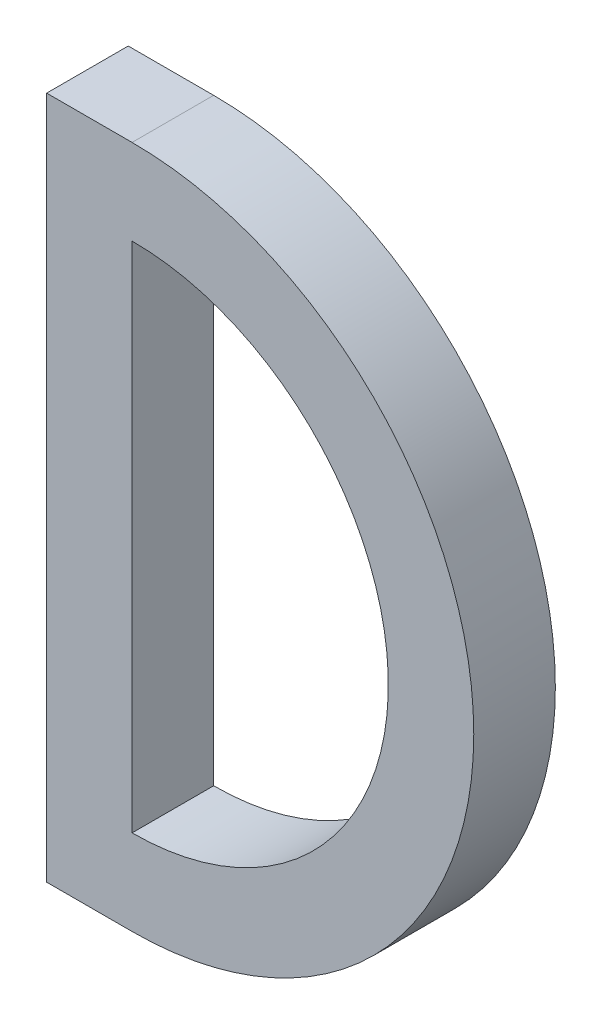
ISO-10303-21;
HEADER;
FILE_DESCRIPTION(('STEP AP214'),'2;1');
FILE_NAME('part.step','',(''),(''),'','','');
FILE_SCHEMA(('AUTOMOTIVE_DESIGN { 1 0 10303 214 1 1 1 1 }'));
ENDSEC;
DATA;
#1=APPLICATION_CONTEXT('core data for automotive mechanical design processes');
#2=APPLICATION_PROTOCOL_DEFINITION('international standard','automotive_design',2000,#1);
#3=PRODUCT_CONTEXT('',#1,'mechanical');
#4=PRODUCT('Part','Part','',(#3));
#5=PRODUCT_RELATED_PRODUCT_CATEGORY('part','',(#4));
#6=PRODUCT_DEFINITION_FORMATION('','',#4);
#7=PRODUCT_DEFINITION_CONTEXT('part definition',#1,'design');
#8=PRODUCT_DEFINITION('design','',#6,#7);
#9=PRODUCT_DEFINITION_SHAPE('','',#8);
#10=(LENGTH_UNIT() NAMED_UNIT(*) SI_UNIT(.MILLI.,.METRE.));
#11=(NAMED_UNIT(*) PLANE_ANGLE_UNIT() SI_UNIT($,.RADIAN.));
#12=(NAMED_UNIT(*) SI_UNIT($,.STERADIAN.) SOLID_ANGLE_UNIT());
#13=UNCERTAINTY_MEASURE_WITH_UNIT(LENGTH_MEASURE(1.E-05),#10,'distance_accuracy_value','');
#14=(GEOMETRIC_REPRESENTATION_CONTEXT(3) GLOBAL_UNCERTAINTY_ASSIGNED_CONTEXT((#13)) GLOBAL_UNIT_ASSIGNED_CONTEXT((#10,
#11,#12)) REPRESENTATION_CONTEXT('',''));
#15=CARTESIAN_POINT('',(0.,0.,0.));
#16=DIRECTION('',(0.,0.,1.));
#17=DIRECTION('',(1.,0.,0.));
#18=AXIS2_PLACEMENT_3D('',#15,#16,#17);
#19=CARTESIAN_POINT('',(-5.,0.,4.7752));
#20=DIRECTION('',(1.,0.,0.));
#21=DIRECTION('',(0.,0.,-1.));
#22=AXIS2_PLACEMENT_3D('',#19,#20,#21);
#23=PLANE('',#22);
#24=DIRECTION('',(0.,-1.,0.));
#25=VECTOR('',#24,1.);
#26=CARTESIAN_POINT('',(-5.,0.,0.));
#27=LINE('',#26,#25);
#28=CARTESIAN_POINT('',(-5.,40.,0.));
#29=VERTEX_POINT('',#28);
#30=CARTESIAN_POINT('',(-5.,0.,0.));
#31=VERTEX_POINT('',#30);
#32=EDGE_CURVE('E140',#29,#31,#27,.T.);
#33=ORIENTED_EDGE('',*,*,#32,.T.);
#34=DIRECTION('',(0.,0.,-1.));
#35=VECTOR('',#34,1.);
#36=CARTESIAN_POINT('',(-5.,0.,4.7752));
#37=LINE('',#36,#35);
#38=CARTESIAN_POINT('',(-5.,0.,4.7752));
#39=VERTEX_POINT('',#38);
#40=EDGE_CURVE('E11',#39,#31,#37,.T.);
#41=ORIENTED_EDGE('',*,*,#40,.F.);
#42=DIRECTION('',(0.,-1.,0.));
#43=VECTOR('',#42,1.);
#44=CARTESIAN_POINT('',(-5.,0.,4.7752));
#45=LINE('',#44,#43);
#46=CARTESIAN_POINT('',(-5.,40.,4.7752));
#47=VERTEX_POINT('',#46);
#48=EDGE_CURVE('E112',#47,#39,#45,.T.);
#49=ORIENTED_EDGE('',*,*,#48,.F.);
#50=DIRECTION('',(0.,0.,-1.));
#51=VECTOR('',#50,1.);
#52=CARTESIAN_POINT('',(-5.,40.,4.7752));
#53=LINE('',#52,#51);
#54=EDGE_CURVE('E152',#47,#29,#53,.T.);
#55=ORIENTED_EDGE('',*,*,#54,.T.);
#56=EDGE_LOOP('',(#33,#41,#49,#55));
#57=FACE_BOUND('',#56,.T.);
#58=ADVANCED_FACE('F45',(#57),#23,.F.);
#59=CARTESIAN_POINT('',(0.,0.,4.7752));
#60=DIRECTION('',(0.,1.,0.));
#61=DIRECTION('',(0.,0.,1.));
#62=AXIS2_PLACEMENT_3D('',#59,#60,#61);
#63=PLANE('',#62);
#64=DIRECTION('',(1.,0.,0.));
#65=VECTOR('',#64,1.);
#66=CARTESIAN_POINT('',(0.,0.,0.));
#67=LINE('',#66,#65);
#68=CARTESIAN_POINT('',(0.,0.,0.));
#69=VERTEX_POINT('',#68);
#70=EDGE_CURVE('E119',#31,#69,#67,.T.);
#71=ORIENTED_EDGE('',*,*,#70,.T.);
#72=DIRECTION('',(0.,0.,-1.));
#73=VECTOR('',#72,1.);
#74=CARTESIAN_POINT('',(0.,0.,4.7752));
#75=LINE('',#74,#73);
#76=CARTESIAN_POINT('',(0.,0.,4.7752));
#77=VERTEX_POINT('',#76);
#78=EDGE_CURVE('E56',#77,#69,#75,.T.);
#79=ORIENTED_EDGE('',*,*,#78,.F.);
#80=DIRECTION('',(1.,0.,0.));
#81=VECTOR('',#80,1.);
#82=CARTESIAN_POINT('',(0.,0.,4.7752));
#83=LINE('',#82,#81);
#84=EDGE_CURVE('E106',#39,#77,#83,.T.);
#85=ORIENTED_EDGE('',*,*,#84,.F.);
#86=ORIENTED_EDGE('',*,*,#40,.T.);
#87=EDGE_LOOP('',(#71,#79,#85,#86));
#88=FACE_BOUND('',#87,.T.);
#89=ADVANCED_FACE('F118',(#88),#63,.F.);
#90=CARTESIAN_POINT('',(0.,20.,4.7752));
#91=DIRECTION('',(0.,0.,-1.));
#92=DIRECTION('',(-1.,0.,0.));
#93=AXIS2_PLACEMENT_3D('',#90,#91,#92);
#94=CYLINDRICAL_SURFACE('',#93,20.);
#95=CARTESIAN_POINT('',(0.,20.,0.));
#96=DIRECTION('',(0.,0.,1.));
#97=DIRECTION('',(1.,0.,0.));
#98=AXIS2_PLACEMENT_3D('',#95,#96,#97);
#99=CIRCLE('',#98,20.);
#100=CARTESIAN_POINT('',(0.,40.,0.));
#101=VERTEX_POINT('',#100);
#102=EDGE_CURVE('E146',#101,#69,#99,.F.);
#103=ORIENTED_EDGE('',*,*,#102,.F.);
#104=DIRECTION('',(0.,0.,-1.));
#105=VECTOR('',#104,1.);
#106=CARTESIAN_POINT('',(0.,40.,4.7752));
#107=LINE('',#106,#105);
#108=CARTESIAN_POINT('',(0.,40.,4.7752));
#109=VERTEX_POINT('',#108);
#110=EDGE_CURVE('E87',#109,#101,#107,.T.);
#111=ORIENTED_EDGE('',*,*,#110,.F.);
#112=CARTESIAN_POINT('',(0.,20.,4.7752));
#113=DIRECTION('',(0.,0.,1.));
#114=DIRECTION('',(1.,0.,0.));
#115=AXIS2_PLACEMENT_3D('',#112,#113,#114);
#116=CIRCLE('',#115,20.);
#117=EDGE_CURVE('E110',#109,#77,#116,.F.);
#118=ORIENTED_EDGE('',*,*,#117,.T.);
#119=ORIENTED_EDGE('',*,*,#78,.T.);
#120=EDGE_LOOP('',(#103,#111,#118,#119));
#121=FACE_BOUND('',#120,.T.);
#122=ADVANCED_FACE('F125',(#121),#94,.T.);
#123=CARTESIAN_POINT('',(0.,20.,4.7752));
#124=DIRECTION('',(0.,0.,-1.));
#125=DIRECTION('',(-1.,0.,0.));
#126=AXIS2_PLACEMENT_3D('',#123,#124,#125);
#127=CYLINDRICAL_SURFACE('',#126,15.);
#128=CARTESIAN_POINT('',(0.,20.,0.));
#129=DIRECTION('',(0.,0.,1.));
#130=DIRECTION('',(1.,0.,0.));
#131=AXIS2_PLACEMENT_3D('',#128,#129,#130);
#132=CIRCLE('',#131,15.);
#133=CARTESIAN_POINT('',(0.,35.,0.));
#134=VERTEX_POINT('',#133);
#135=CARTESIAN_POINT('',(0.,5.,0.));
#136=VERTEX_POINT('',#135);
#137=EDGE_CURVE('E133',#134,#136,#132,.F.);
#138=ORIENTED_EDGE('',*,*,#137,.T.);
#139=DIRECTION('',(0.,0.,-1.));
#140=VECTOR('',#139,1.);
#141=CARTESIAN_POINT('',(0.,5.,4.7752));
#142=LINE('',#141,#140);
#143=CARTESIAN_POINT('',(0.,5.,4.7752));
#144=VERTEX_POINT('',#143);
#145=EDGE_CURVE('E49',#144,#136,#142,.T.);
#146=ORIENTED_EDGE('',*,*,#145,.F.);
#147=CARTESIAN_POINT('',(0.,20.,4.7752));
#148=DIRECTION('',(0.,0.,1.));
#149=DIRECTION('',(1.,0.,0.));
#150=AXIS2_PLACEMENT_3D('',#147,#148,#149);
#151=CIRCLE('',#150,15.);
#152=CARTESIAN_POINT('',(0.,35.,4.7752));
#153=VERTEX_POINT('',#152);
#154=EDGE_CURVE('E151',#153,#144,#151,.F.);
#155=ORIENTED_EDGE('',*,*,#154,.F.);
#156=DIRECTION('',(0.,0.,-1.));
#157=VECTOR('',#156,1.);
#158=CARTESIAN_POINT('',(0.,35.,4.7752));
#159=LINE('',#158,#157);
#160=EDGE_CURVE('E129',#153,#134,#159,.T.);
#161=ORIENTED_EDGE('',*,*,#160,.T.);
#162=EDGE_LOOP('',(#138,#146,#155,#161));
#163=FACE_BOUND('',#162,.T.);
#164=ADVANCED_FACE('F47',(#163),#127,.F.);
#165=CARTESIAN_POINT('',(0.,0.,4.7752));
#166=DIRECTION('',(-1.,0.,0.));
#167=DIRECTION('',(0.,-1.,0.));
#168=AXIS2_PLACEMENT_3D('',#165,#166,#167);
#169=PLANE('',#168);
#170=DIRECTION('',(0.,1.,0.));
#171=VECTOR('',#170,1.);
#172=CARTESIAN_POINT('',(0.,0.,0.));
#173=LINE('',#172,#171);
#174=EDGE_CURVE('E137',#136,#134,#173,.T.);
#175=ORIENTED_EDGE('',*,*,#174,.T.);
#176=ORIENTED_EDGE('',*,*,#160,.F.);
#177=DIRECTION('',(0.,1.,0.));
#178=VECTOR('',#177,1.);
#179=CARTESIAN_POINT('',(0.,0.,4.7752));
#180=LINE('',#179,#178);
#181=EDGE_CURVE('E99',#144,#153,#180,.T.);
#182=ORIENTED_EDGE('',*,*,#181,.F.);
#183=ORIENTED_EDGE('',*,*,#145,.T.);
#184=EDGE_LOOP('',(#175,#176,#182,#183));
#185=FACE_BOUND('',#184,.T.);
#186=ADVANCED_FACE('F163',(#185),#169,.F.);
#187=CARTESIAN_POINT('',(0.,40.,4.7752));
#188=DIRECTION('',(0.,-1.,0.));
#189=DIRECTION('',(0.,0.,-1.));
#190=AXIS2_PLACEMENT_3D('',#187,#188,#189);
#191=PLANE('',#190);
#192=DIRECTION('',(-1.,0.,0.));
#193=VECTOR('',#192,1.);
#194=CARTESIAN_POINT('',(0.,40.,0.));
#195=LINE('',#194,#193);
#196=EDGE_CURVE('E90',#101,#29,#195,.T.);
#197=ORIENTED_EDGE('',*,*,#196,.T.);
#198=ORIENTED_EDGE('',*,*,#54,.F.);
#199=DIRECTION('',(-1.,0.,0.));
#200=VECTOR('',#199,1.);
#201=CARTESIAN_POINT('',(0.,40.,4.7752));
#202=LINE('',#201,#200);
#203=EDGE_CURVE('E65',#109,#47,#202,.T.);
#204=ORIENTED_EDGE('',*,*,#203,.F.);
#205=ORIENTED_EDGE('',*,*,#110,.T.);
#206=EDGE_LOOP('',(#197,#198,#204,#205));
#207=FACE_BOUND('',#206,.T.);
#208=ADVANCED_FACE('F171',(#207),#191,.F.);
#209=CARTESIAN_POINT('',(0.,0.,4.7752));
#210=DIRECTION('',(0.,0.,1.));
#211=DIRECTION('',(1.,0.,0.));
#212=AXIS2_PLACEMENT_3D('',#209,#210,#211);
#213=PLANE('',#212);
#214=ORIENTED_EDGE('',*,*,#154,.T.);
#215=ORIENTED_EDGE('',*,*,#181,.T.);
#216=EDGE_LOOP('',(#214,#215));
#217=FACE_BOUND('',#216,.T.);
#218=ORIENTED_EDGE('',*,*,#48,.T.);
#219=ORIENTED_EDGE('',*,*,#84,.T.);
#220=ORIENTED_EDGE('',*,*,#117,.F.);
#221=ORIENTED_EDGE('',*,*,#203,.T.);
#222=EDGE_LOOP('',(#218,#219,#220,#221));
#223=FACE_BOUND('',#222,.T.);
#224=ADVANCED_FACE('F108',(#217,#223),#213,.T.);
#225=CARTESIAN_POINT('',(0.,0.,0.));
#226=DIRECTION('',(0.,0.,1.));
#227=DIRECTION('',(1.,0.,0.));
#228=AXIS2_PLACEMENT_3D('',#225,#226,#227);
#229=PLANE('',#228);
#230=ORIENTED_EDGE('',*,*,#137,.F.);
#231=ORIENTED_EDGE('',*,*,#174,.F.);
#232=EDGE_LOOP('',(#230,#231));
#233=FACE_BOUND('',#232,.T.);
#234=ORIENTED_EDGE('',*,*,#32,.F.);
#235=ORIENTED_EDGE('',*,*,#196,.F.);
#236=ORIENTED_EDGE('',*,*,#102,.T.);
#237=ORIENTED_EDGE('',*,*,#70,.F.);
#238=EDGE_LOOP('',(#234,#235,#236,#237));
#239=FACE_BOUND('',#238,.T.);
#240=ADVANCED_FACE('F165',(#233,#239),#229,.F.);
#241=CLOSED_SHELL('',(#58,#89,#122,#164,#186,#208,#224,#240));
#242=MANIFOLD_SOLID_BREP('B2',#241);
#243=ADVANCED_BREP_SHAPE_REPRESENTATION('',(#18,#242),#14);
#244=SHAPE_DEFINITION_REPRESENTATION(#9,#243);
ENDSEC;
END-ISO-10303-21;
